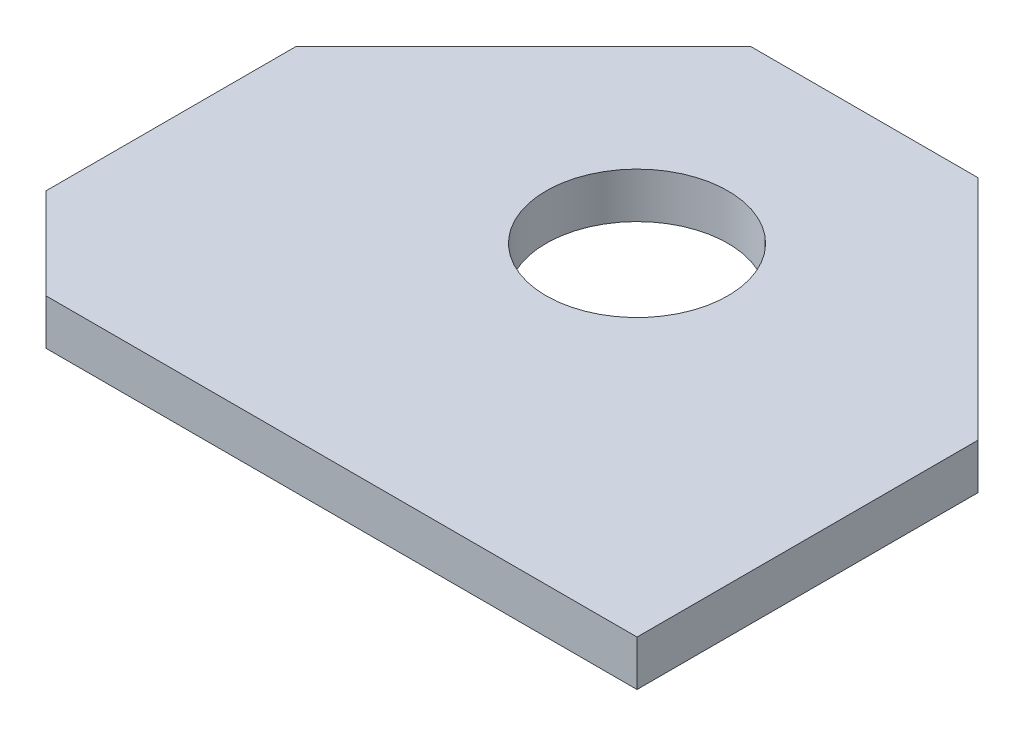
ISO-10303-21;
HEADER;
FILE_DESCRIPTION(('STEP AP214'),'2;1');
FILE_NAME('part.step','',(''),(''),'','','');
FILE_SCHEMA(('AUTOMOTIVE_DESIGN { 1 0 10303 214 1 1 1 1 }'));
ENDSEC;
DATA;
#1=APPLICATION_CONTEXT('core data for automotive mechanical design processes');
#2=APPLICATION_PROTOCOL_DEFINITION('international standard','automotive_design',2000,#1);
#3=PRODUCT_CONTEXT('',#1,'mechanical');
#4=PRODUCT('Part','Part','',(#3));
#5=PRODUCT_RELATED_PRODUCT_CATEGORY('part','',(#4));
#6=PRODUCT_DEFINITION_FORMATION('','',#4);
#7=PRODUCT_DEFINITION_CONTEXT('part definition',#1,'design');
#8=PRODUCT_DEFINITION('design','',#6,#7);
#9=PRODUCT_DEFINITION_SHAPE('','',#8);
#10=(LENGTH_UNIT() NAMED_UNIT(*) SI_UNIT(.MILLI.,.METRE.));
#11=(NAMED_UNIT(*) PLANE_ANGLE_UNIT() SI_UNIT($,.RADIAN.));
#12=(NAMED_UNIT(*) SI_UNIT($,.STERADIAN.) SOLID_ANGLE_UNIT());
#13=UNCERTAINTY_MEASURE_WITH_UNIT(LENGTH_MEASURE(1.E-05),#10,'distance_accuracy_value','');
#14=(GEOMETRIC_REPRESENTATION_CONTEXT(3) GLOBAL_UNCERTAINTY_ASSIGNED_CONTEXT((#13)) GLOBAL_UNIT_ASSIGNED_CONTEXT((#10,
#11,#12)) REPRESENTATION_CONTEXT('',''));
#15=CARTESIAN_POINT('',(0.,0.,0.));
#16=DIRECTION('',(0.,0.,1.));
#17=DIRECTION('',(1.,0.,0.));
#18=AXIS2_PLACEMENT_3D('',#15,#16,#17);
#19=CARTESIAN_POINT('',(0.,1.,0.));
#20=DIRECTION('',(0.,1.,0.));
#21=DIRECTION('',(0.,0.,1.));
#22=AXIS2_PLACEMENT_3D('',#19,#20,#21);
#23=PLANE('',#22);
#24=DIRECTION('',(0.,0.,1.));
#25=VECTOR('',#24,1.);
#26=CARTESIAN_POINT('',(-15.,1.,-2.49999999999998));
#27=LINE('',#26,#25);
#28=CARTESIAN_POINT('',(-15.,1.,-2.49999999999998));
#29=VERTEX_POINT('',#28);
#30=CARTESIAN_POINT('',(-15.,1.,8.5));
#31=VERTEX_POINT('',#30);
#32=EDGE_CURVE('E99',#29,#31,#27,.T.);
#33=ORIENTED_EDGE('',*,*,#32,.T.);
#34=DIRECTION('',(-0.707106781186546,0.,-0.707106781186549));
#35=VECTOR('',#34,1.);
#36=CARTESIAN_POINT('',(-11.75,1.,11.75));
#37=LINE('',#36,#35);
#38=CARTESIAN_POINT('',(-11.,1.,12.5));
#39=VERTEX_POINT('',#38);
#40=EDGE_CURVE('E11',#31,#39,#37,.F.);
#41=ORIENTED_EDGE('',*,*,#40,.T.);
#42=DIRECTION('',(1.,0.,0.));
#43=VECTOR('',#42,1.);
#44=CARTESIAN_POINT('',(-15.,1.,12.5));
#45=LINE('',#44,#43);
#46=CARTESIAN_POINT('',(15.,1.,12.5));
#47=VERTEX_POINT('',#46);
#48=EDGE_CURVE('E107',#39,#47,#45,.T.);
#49=ORIENTED_EDGE('',*,*,#48,.T.);
#50=DIRECTION('',(0.,0.,-1.));
#51=VECTOR('',#50,1.);
#52=CARTESIAN_POINT('',(15.,1.,-2.49999999999998));
#53=LINE('',#52,#51);
#54=CARTESIAN_POINT('',(15.,1.,-2.49999999999998));
#55=VERTEX_POINT('',#54);
#56=EDGE_CURVE('E153',#47,#55,#53,.T.);
#57=ORIENTED_EDGE('',*,*,#56,.T.);
#58=DIRECTION('',(-0.707106781186547,0.,-0.707106781186548));
#59=VECTOR('',#58,1.);
#60=CARTESIAN_POINT('',(5.00000000000001,1.,-12.5));
#61=LINE('',#60,#59);
#62=CARTESIAN_POINT('',(5.00000000000001,1.,-12.5));
#63=VERTEX_POINT('',#62);
#64=EDGE_CURVE('E151',#55,#63,#61,.T.);
#65=ORIENTED_EDGE('',*,*,#64,.T.);
#66=DIRECTION('',(-1.,0.,0.));
#67=VECTOR('',#66,1.);
#68=CARTESIAN_POINT('',(5.00000000000001,1.,-12.5));
#69=LINE('',#68,#67);
#70=CARTESIAN_POINT('',(-5.,1.,-12.5));
#71=VERTEX_POINT('',#70);
#72=EDGE_CURVE('E113',#63,#71,#69,.T.);
#73=ORIENTED_EDGE('',*,*,#72,.T.);
#74=DIRECTION('',(-0.707106781186547,0.,0.707106781186548));
#75=VECTOR('',#74,1.);
#76=CARTESIAN_POINT('',(-5.,1.,-12.5));
#77=LINE('',#76,#75);
#78=EDGE_CURVE('E108',#71,#29,#77,.T.);
#79=ORIENTED_EDGE('',*,*,#78,.T.);
#80=EDGE_LOOP('',(#33,#41,#49,#57,#65,#73,#79));
#81=FACE_BOUND('',#80,.T.);
#82=CARTESIAN_POINT('',(0.,1.,-2.49999999999999));
#83=DIRECTION('',(0.,1.,0.));
#84=DIRECTION('',(0.,0.,1.));
#85=AXIS2_PLACEMENT_3D('',#82,#83,#84);
#86=CIRCLE('',#85,4.);
#87=CARTESIAN_POINT('',(0.,1.,1.50000000000001));
#88=VERTEX_POINT('',#87);
#89=EDGE_CURVE('E149',#88,#88,#86,.T.);
#90=ORIENTED_EDGE('',*,*,#89,.F.);
#91=EDGE_LOOP('',(#90));
#92=FACE_BOUND('',#91,.T.);
#93=ADVANCED_FACE('F43',(#81,#92),#23,.T.);
#94=CARTESIAN_POINT('',(0.,-1.,0.));
#95=DIRECTION('',(0.,1.,0.));
#96=DIRECTION('',(0.,0.,1.));
#97=AXIS2_PLACEMENT_3D('',#94,#95,#96);
#98=PLANE('',#97);
#99=DIRECTION('',(1.,0.,0.));
#100=VECTOR('',#99,1.);
#101=CARTESIAN_POINT('',(-15.,-1.,12.5));
#102=LINE('',#101,#100);
#103=CARTESIAN_POINT('',(-11.,-1.,12.5));
#104=VERTEX_POINT('',#103);
#105=CARTESIAN_POINT('',(15.,-1.,12.5));
#106=VERTEX_POINT('',#105);
#107=EDGE_CURVE('E144',#104,#106,#102,.T.);
#108=ORIENTED_EDGE('',*,*,#107,.F.);
#109=DIRECTION('',(0.707106781186546,0.,0.707106781186549));
#110=VECTOR('',#109,1.);
#111=CARTESIAN_POINT('',(-11.,-1.,12.5));
#112=LINE('',#111,#110);
#113=CARTESIAN_POINT('',(-15.,-1.,8.5));
#114=VERTEX_POINT('',#113);
#115=EDGE_CURVE('E66',#104,#114,#112,.F.);
#116=ORIENTED_EDGE('',*,*,#115,.T.);
#117=DIRECTION('',(0.,0.,1.));
#118=VECTOR('',#117,1.);
#119=CARTESIAN_POINT('',(-15.,-1.,-2.49999999999998));
#120=LINE('',#119,#118);
#121=CARTESIAN_POINT('',(-15.,-1.,-2.49999999999998));
#122=VERTEX_POINT('',#121);
#123=EDGE_CURVE('E146',#122,#114,#120,.T.);
#124=ORIENTED_EDGE('',*,*,#123,.F.);
#125=DIRECTION('',(-0.707106781186547,0.,0.707106781186548));
#126=VECTOR('',#125,1.);
#127=CARTESIAN_POINT('',(-5.,-1.,-12.5));
#128=LINE('',#127,#126);
#129=CARTESIAN_POINT('',(-5.,-1.,-12.5));
#130=VERTEX_POINT('',#129);
#131=EDGE_CURVE('E121',#130,#122,#128,.T.);
#132=ORIENTED_EDGE('',*,*,#131,.F.);
#133=DIRECTION('',(-1.,0.,0.));
#134=VECTOR('',#133,1.);
#135=CARTESIAN_POINT('',(5.00000000000001,-1.,-12.5));
#136=LINE('',#135,#134);
#137=CARTESIAN_POINT('',(5.00000000000001,-1.,-12.5));
#138=VERTEX_POINT('',#137);
#139=EDGE_CURVE('E117',#138,#130,#136,.T.);
#140=ORIENTED_EDGE('',*,*,#139,.F.);
#141=DIRECTION('',(-0.707106781186547,0.,-0.707106781186548));
#142=VECTOR('',#141,1.);
#143=CARTESIAN_POINT('',(5.00000000000001,-1.,-12.5));
#144=LINE('',#143,#142);
#145=CARTESIAN_POINT('',(15.,-1.,-2.49999999999998));
#146=VERTEX_POINT('',#145);
#147=EDGE_CURVE('E140',#146,#138,#144,.T.);
#148=ORIENTED_EDGE('',*,*,#147,.F.);
#149=DIRECTION('',(0.,0.,-1.));
#150=VECTOR('',#149,1.);
#151=CARTESIAN_POINT('',(15.,-1.,-2.49999999999998));
#152=LINE('',#151,#150);
#153=EDGE_CURVE('E142',#106,#146,#152,.T.);
#154=ORIENTED_EDGE('',*,*,#153,.F.);
#155=EDGE_LOOP('',(#108,#116,#124,#132,#140,#148,#154));
#156=FACE_BOUND('',#155,.T.);
#157=CARTESIAN_POINT('',(0.,-1.,-2.49999999999999));
#158=DIRECTION('',(0.,1.,0.));
#159=DIRECTION('',(0.,0.,1.));
#160=AXIS2_PLACEMENT_3D('',#157,#158,#159);
#161=CIRCLE('',#160,4.);
#162=CARTESIAN_POINT('',(0.,-1.,1.50000000000001));
#163=VERTEX_POINT('',#162);
#164=EDGE_CURVE('E156',#163,#163,#161,.T.);
#165=ORIENTED_EDGE('',*,*,#164,.T.);
#166=EDGE_LOOP('',(#165));
#167=FACE_BOUND('',#166,.T.);
#168=ADVANCED_FACE('F165',(#156,#167),#98,.F.);
#169=CARTESIAN_POINT('',(-5.,1.,-12.5));
#170=DIRECTION('',(0.707106781186548,0.,0.707106781186547));
#171=DIRECTION('',(0.707106781186547,0.,-0.707106781186548));
#172=AXIS2_PLACEMENT_3D('',#169,#170,#171);
#173=PLANE('',#172);
#174=ORIENTED_EDGE('',*,*,#131,.T.);
#175=DIRECTION('',(0.,-1.,0.));
#176=VECTOR('',#175,1.);
#177=CARTESIAN_POINT('',(-15.,1.,-2.49999999999998));
#178=LINE('',#177,#176);
#179=EDGE_CURVE('E103',#29,#122,#178,.T.);
#180=ORIENTED_EDGE('',*,*,#179,.F.);
#181=ORIENTED_EDGE('',*,*,#78,.F.);
#182=DIRECTION('',(0.,-1.,0.));
#183=VECTOR('',#182,1.);
#184=CARTESIAN_POINT('',(-5.,1.,-12.5));
#185=LINE('',#184,#183);
#186=EDGE_CURVE('E137',#71,#130,#185,.T.);
#187=ORIENTED_EDGE('',*,*,#186,.T.);
#188=EDGE_LOOP('',(#174,#180,#181,#187));
#189=FACE_BOUND('',#188,.T.);
#190=ADVANCED_FACE('F119',(#189),#173,.F.);
#191=CARTESIAN_POINT('',(-15.,1.,-2.49999999999998));
#192=DIRECTION('',(1.,0.,0.));
#193=DIRECTION('',(0.,0.,-1.));
#194=AXIS2_PLACEMENT_3D('',#191,#192,#193);
#195=PLANE('',#194);
#196=ORIENTED_EDGE('',*,*,#123,.T.);
#197=DIRECTION('',(0.,1.,0.));
#198=VECTOR('',#197,1.);
#199=CARTESIAN_POINT('',(-15.,1.,8.5));
#200=LINE('',#199,#198);
#201=EDGE_CURVE('E52',#114,#31,#200,.T.);
#202=ORIENTED_EDGE('',*,*,#201,.T.);
#203=ORIENTED_EDGE('',*,*,#32,.F.);
#204=ORIENTED_EDGE('',*,*,#179,.T.);
#205=EDGE_LOOP('',(#196,#202,#203,#204));
#206=FACE_BOUND('',#205,.T.);
#207=ADVANCED_FACE('F101',(#206),#195,.F.);
#208=CARTESIAN_POINT('',(-15.,1.,12.5));
#209=DIRECTION('',(0.,0.,-1.));
#210=DIRECTION('',(-1.,0.,0.));
#211=AXIS2_PLACEMENT_3D('',#208,#209,#210);
#212=PLANE('',#211);
#213=ORIENTED_EDGE('',*,*,#48,.F.);
#214=DIRECTION('',(0.,-1.,0.));
#215=VECTOR('',#214,1.);
#216=CARTESIAN_POINT('',(-11.,1.,12.5));
#217=LINE('',#216,#215);
#218=EDGE_CURVE('E122',#39,#104,#217,.T.);
#219=ORIENTED_EDGE('',*,*,#218,.T.);
#220=ORIENTED_EDGE('',*,*,#107,.T.);
#221=DIRECTION('',(0.,-1.,0.));
#222=VECTOR('',#221,1.);
#223=CARTESIAN_POINT('',(15.,1.,12.5));
#224=LINE('',#223,#222);
#225=EDGE_CURVE('E123',#47,#106,#224,.T.);
#226=ORIENTED_EDGE('',*,*,#225,.F.);
#227=EDGE_LOOP('',(#213,#219,#220,#226));
#228=FACE_BOUND('',#227,.T.);
#229=ADVANCED_FACE('F185',(#228),#212,.F.);
#230=CARTESIAN_POINT('',(15.,1.,-2.49999999999998));
#231=DIRECTION('',(-1.,0.,0.));
#232=DIRECTION('',(0.,0.,1.));
#233=AXIS2_PLACEMENT_3D('',#230,#231,#232);
#234=PLANE('',#233);
#235=ORIENTED_EDGE('',*,*,#153,.T.);
#236=DIRECTION('',(0.,-1.,0.));
#237=VECTOR('',#236,1.);
#238=CARTESIAN_POINT('',(15.,1.,-2.49999999999998));
#239=LINE('',#238,#237);
#240=EDGE_CURVE('E128',#55,#146,#239,.T.);
#241=ORIENTED_EDGE('',*,*,#240,.F.);
#242=ORIENTED_EDGE('',*,*,#56,.F.);
#243=ORIENTED_EDGE('',*,*,#225,.T.);
#244=EDGE_LOOP('',(#235,#241,#242,#243));
#245=FACE_BOUND('',#244,.T.);
#246=ADVANCED_FACE('F181',(#245),#234,.F.);
#247=CARTESIAN_POINT('',(5.00000000000001,1.,-12.5));
#248=DIRECTION('',(-0.707106781186548,0.,0.707106781186547));
#249=DIRECTION('',(0.707106781186547,0.,0.707106781186548));
#250=AXIS2_PLACEMENT_3D('',#247,#248,#249);
#251=PLANE('',#250);
#252=ORIENTED_EDGE('',*,*,#147,.T.);
#253=DIRECTION('',(0.,-1.,0.));
#254=VECTOR('',#253,1.);
#255=CARTESIAN_POINT('',(5.00000000000001,1.,-12.5));
#256=LINE('',#255,#254);
#257=EDGE_CURVE('E134',#63,#138,#256,.T.);
#258=ORIENTED_EDGE('',*,*,#257,.F.);
#259=ORIENTED_EDGE('',*,*,#64,.F.);
#260=ORIENTED_EDGE('',*,*,#240,.T.);
#261=EDGE_LOOP('',(#252,#258,#259,#260));
#262=FACE_BOUND('',#261,.T.);
#263=ADVANCED_FACE('F177',(#262),#251,.F.);
#264=CARTESIAN_POINT('',(5.00000000000001,1.,-12.5));
#265=DIRECTION('',(0.,0.,1.));
#266=DIRECTION('',(1.,0.,0.));
#267=AXIS2_PLACEMENT_3D('',#264,#265,#266);
#268=PLANE('',#267);
#269=ORIENTED_EDGE('',*,*,#139,.T.);
#270=ORIENTED_EDGE('',*,*,#186,.F.);
#271=ORIENTED_EDGE('',*,*,#72,.F.);
#272=ORIENTED_EDGE('',*,*,#257,.T.);
#273=EDGE_LOOP('',(#269,#270,#271,#272));
#274=FACE_BOUND('',#273,.T.);
#275=ADVANCED_FACE('F174',(#274),#268,.F.);
#276=CARTESIAN_POINT('',(0.,1.,-2.49999999999999));
#277=DIRECTION('',(0.,-1.,0.));
#278=DIRECTION('',(0.,0.,-1.));
#279=AXIS2_PLACEMENT_3D('',#276,#277,#278);
#280=CYLINDRICAL_SURFACE('',#279,4.);
#281=ORIENTED_EDGE('',*,*,#89,.T.);
#282=EDGE_LOOP('',(#281));
#283=FACE_BOUND('',#282,.T.);
#284=ORIENTED_EDGE('',*,*,#164,.F.);
#285=EDGE_LOOP('',(#284));
#286=FACE_BOUND('',#285,.T.);
#287=ADVANCED_FACE('F162',(#283,#286),#280,.F.);
#288=CARTESIAN_POINT('',(-11.,1.,12.5));
#289=DIRECTION('',(0.707106781186549,0.,-0.707106781186546));
#290=DIRECTION('',(0.,-1.,0.));
#291=AXIS2_PLACEMENT_3D('',#288,#289,#290);
#292=PLANE('',#291);
#293=ORIENTED_EDGE('',*,*,#40,.F.);
#294=ORIENTED_EDGE('',*,*,#201,.F.);
#295=ORIENTED_EDGE('',*,*,#115,.F.);
#296=ORIENTED_EDGE('',*,*,#218,.F.);
#297=EDGE_LOOP('',(#293,#294,#295,#296));
#298=FACE_BOUND('',#297,.T.);
#299=ADVANCED_FACE('F46',(#298),#292,.F.);
#300=CLOSED_SHELL('',(#93,#168,#190,#207,#229,#246,#263,#275,#287,#299));
#301=MANIFOLD_SOLID_BREP('B2',#300);
#302=ADVANCED_BREP_SHAPE_REPRESENTATION('',(#18,#301),#14);
#303=SHAPE_DEFINITION_REPRESENTATION(#9,#302);
ENDSEC;
END-ISO-10303-21;
